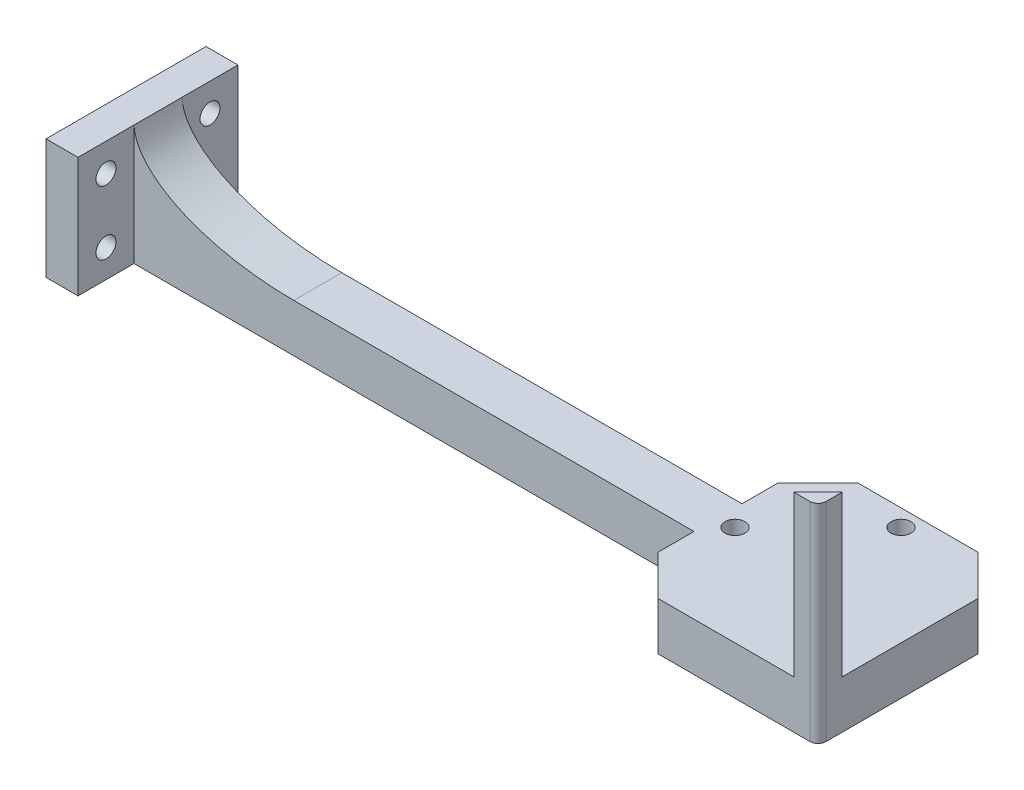
ISO-10303-21;
HEADER;
FILE_DESCRIPTION(('STEP AP214'),'2;1');
FILE_NAME('part.step','',(''),(''),'','','');
FILE_SCHEMA(('AUTOMOTIVE_DESIGN { 1 0 10303 214 1 1 1 1 }'));
ENDSEC;
DATA;
#1=APPLICATION_CONTEXT('core data for automotive mechanical design processes');
#2=APPLICATION_PROTOCOL_DEFINITION('international standard','automotive_design',2000,#1);
#3=PRODUCT_CONTEXT('',#1,'mechanical');
#4=PRODUCT('Part','Part','',(#3));
#5=PRODUCT_RELATED_PRODUCT_CATEGORY('part','',(#4));
#6=PRODUCT_DEFINITION_FORMATION('','',#4);
#7=PRODUCT_DEFINITION_CONTEXT('part definition',#1,'design');
#8=PRODUCT_DEFINITION('design','',#6,#7);
#9=PRODUCT_DEFINITION_SHAPE('','',#8);
#10=(LENGTH_UNIT() NAMED_UNIT(*) SI_UNIT(.MILLI.,.METRE.));
#11=(NAMED_UNIT(*) PLANE_ANGLE_UNIT() SI_UNIT($,.RADIAN.));
#12=(NAMED_UNIT(*) SI_UNIT($,.STERADIAN.) SOLID_ANGLE_UNIT());
#13=UNCERTAINTY_MEASURE_WITH_UNIT(LENGTH_MEASURE(1.E-05),#10,'distance_accuracy_value','');
#14=(GEOMETRIC_REPRESENTATION_CONTEXT(3) GLOBAL_UNCERTAINTY_ASSIGNED_CONTEXT((#13)) GLOBAL_UNIT_ASSIGNED_CONTEXT((#10,
#11,#12)) REPRESENTATION_CONTEXT('',''));
#15=CARTESIAN_POINT('',(0.,0.,0.));
#16=DIRECTION('',(0.,0.,1.));
#17=DIRECTION('',(1.,0.,0.));
#18=AXIS2_PLACEMENT_3D('',#15,#16,#17);
#19=CARTESIAN_POINT('',(0.,12.,0.));
#20=DIRECTION('',(0.,1.,0.));
#21=DIRECTION('',(0.,0.,1.));
#22=AXIS2_PLACEMENT_3D('',#19,#20,#21);
#23=PLANE('',#22);
#24=CARTESIAN_POINT('',(69.4117647058823,12.,-14.7173797712898));
#25=DIRECTION('',(0.,1.,0.));
#26=DIRECTION('',(0.,0.,1.));
#27=AXIS2_PLACEMENT_3D('',#24,#25,#26);
#28=CIRCLE('',#27,2.49999999999999);
#29=CARTESIAN_POINT('',(69.4117647058823,12.,-12.2173797712898));
#30=VERTEX_POINT('',#29);
#31=EDGE_CURVE('E791',#30,#30,#28,.F.);
#32=ORIENTED_EDGE('',*,*,#31,.T.);
#33=EDGE_LOOP('',(#32));
#34=FACE_BOUND('',#33,.T.);
#35=CARTESIAN_POINT('',(48.6517647058823,12.,6.04262022871021));
#36=DIRECTION('',(0.,1.,0.));
#37=DIRECTION('',(0.,0.,1.));
#38=AXIS2_PLACEMENT_3D('',#35,#36,#37);
#39=CIRCLE('',#38,2.49999999999999);
#40=CARTESIAN_POINT('',(48.6517647058823,12.,8.54262022871021));
#41=VERTEX_POINT('',#40);
#42=EDGE_CURVE('E795',#41,#41,#39,.F.);
#43=ORIENTED_EDGE('',*,*,#42,.T.);
#44=EDGE_LOOP('',(#43));
#45=FACE_BOUND('',#44,.T.);
#46=CARTESIAN_POINT('',(87.4117647058823,12.,24.0426202287102));
#47=DIRECTION('',(0.,1.,0.));
#48=DIRECTION('',(0.,0.,1.));
#49=AXIS2_PLACEMENT_3D('',#46,#47,#48);
#50=CIRCLE('',#49,2.5);
#51=CARTESIAN_POINT('',(87.4117647058823,12.,26.5426202287102));
#52=VERTEX_POINT('',#51);
#53=EDGE_CURVE('E801',#52,#52,#50,.T.);
#54=ORIENTED_EDGE('',*,*,#53,.F.);
#55=EDGE_LOOP('',(#54));
#56=FACE_BOUND('',#55,.T.);
#57=CARTESIAN_POINT('',(69.4117647058823,12.,6.04262022871021));
#58=DIRECTION('',(0.,1.,0.));
#59=DIRECTION('',(0.,0.,1.));
#60=AXIS2_PLACEMENT_3D('',#57,#58,#59);
#61=CIRCLE('',#60,4.25000000000001);
#62=CARTESIAN_POINT('',(69.4117647058823,12.,10.2926202287102));
#63=VERTEX_POINT('',#62);
#64=EDGE_CURVE('E225',#63,#63,#61,.T.);
#65=ORIENTED_EDGE('',*,*,#64,.F.);
#66=EDGE_LOOP('',(#65));
#67=FACE_BOUND('',#66,.T.);
#68=DIRECTION('',(1.,0.,0.));
#69=VECTOR('',#68,1.);
#70=CARTESIAN_POINT('',(0.,12.,31.0426202287102));
#71=LINE('',#70,#69);
#72=CARTESIAN_POINT('',(54.4117647058824,12.,31.0426202287102));
#73=VERTEX_POINT('',#72);
#74=CARTESIAN_POINT('',(88.4117647058823,12.,31.0426202287102));
#75=VERTEX_POINT('',#74);
#76=EDGE_CURVE('E488',#73,#75,#71,.T.);
#77=ORIENTED_EDGE('',*,*,#76,.T.);
#78=DIRECTION('',(-0.707106781186548,0.,0.707106781186547));
#79=VECTOR('',#78,1.);
#80=CARTESIAN_POINT('',(94.4117647058823,12.,25.0426202287102));
#81=LINE('',#80,#79);
#82=CARTESIAN_POINT('',(94.4117647058823,12.,25.0426202287102));
#83=VERTEX_POINT('',#82);
#84=EDGE_CURVE('E182',#83,#75,#81,.T.);
#85=ORIENTED_EDGE('',*,*,#84,.F.);
#86=DIRECTION('',(0.,0.,1.));
#87=VECTOR('',#86,1.);
#88=CARTESIAN_POINT('',(94.4117647058823,12.,0.));
#89=LINE('',#88,#87);
#90=CARTESIAN_POINT('',(94.4117647058823,12.,-8.95737977128982));
#91=VERTEX_POINT('',#90);
#92=EDGE_CURVE('E196',#91,#83,#89,.T.);
#93=ORIENTED_EDGE('',*,*,#92,.F.);
#94=DIRECTION('',(0.707106781186547,0.,0.707106781186548));
#95=VECTOR('',#94,1.);
#96=CARTESIAN_POINT('',(51.6845722385862,12.,-51.6845722385861));
#97=LINE('',#96,#95);
#98=CARTESIAN_POINT('',(84.4117647058824,12.,-18.9573797712898));
#99=VERTEX_POINT('',#98);
#100=EDGE_CURVE('E533',#91,#99,#97,.F.);
#101=ORIENTED_EDGE('',*,*,#100,.T.);
#102=DIRECTION('',(1.,0.,0.));
#103=VECTOR('',#102,1.);
#104=CARTESIAN_POINT('',(0.,12.,-18.9573797712898));
#105=LINE('',#104,#103);
#106=CARTESIAN_POINT('',(54.4117647058824,12.,-18.9573797712898));
#107=VERTEX_POINT('',#106);
#108=EDGE_CURVE('E526',#107,#99,#105,.T.);
#109=ORIENTED_EDGE('',*,*,#108,.F.);
#110=DIRECTION('',(-0.707106781186549,0.,0.707106781186547));
#111=VECTOR('',#110,1.);
#112=CARTESIAN_POINT('',(17.7271924672962,12.,17.7271924672963));
#113=LINE('',#112,#111);
#114=CARTESIAN_POINT('',(44.4117647058823,12.,-8.95737977128978));
#115=VERTEX_POINT('',#114);
#116=EDGE_CURVE('E535',#107,#115,#113,.T.);
#117=ORIENTED_EDGE('',*,*,#116,.T.);
#118=DIRECTION('',(0.,0.,1.));
#119=VECTOR('',#118,1.);
#120=CARTESIAN_POINT('',(44.4117647058823,12.,0.));
#121=LINE('',#120,#119);
#122=CARTESIAN_POINT('',(44.4117647058823,12.,0.0426202287102109));
#123=VERTEX_POINT('',#122);
#124=EDGE_CURVE('E523',#115,#123,#121,.T.);
#125=ORIENTED_EDGE('',*,*,#124,.T.);
#126=DIRECTION('',(-1.,0.,0.));
#127=VECTOR('',#126,1.);
#128=CARTESIAN_POINT('',(44.4117647058823,12.,0.0426202287102109));
#129=LINE('',#128,#127);
#130=CARTESIAN_POINT('',(-55.6382665832413,12.,0.0426202287102231));
#131=VERTEX_POINT('',#130);
#132=EDGE_CURVE('E464',#123,#131,#129,.T.);
#133=ORIENTED_EDGE('',*,*,#132,.T.);
#134=CARTESIAN_POINT('',(-55.6382665832413,12.,12.6426202287102));
#135=CARTESIAN_POINT('',(-55.6382665832413,12.,8.24262022871021));
#136=CARTESIAN_POINT('',(-55.6382665832413,12.,3.84262022871024));
#137=CARTESIAN_POINT('',(-55.6382665832413,12.,-0.557379771289768));
#138=(BOUNDED_CURVE() B_SPLINE_CURVE(3,(#134,#135,#136,#137),.UNSPECIFIED.,.F.,
.F.) B_SPLINE_CURVE_WITH_KNOTS((4,4),(0.0134,0.0266),
.UNSPECIFIED.) CURVE() GEOMETRIC_REPRESENTATION_ITEM() RATIONAL_B_SPLINE_CURVE((1.,1.,1.,1.)) REPRESENTATION_ITEM(''));
#139=CARTESIAN_POINT('',(-55.6382665832413,12.,12.0426202287102));
#140=VERTEX_POINT('',#139);
#141=EDGE_CURVE('E547',#131,#140,#138,.F.);
#142=ORIENTED_EDGE('',*,*,#141,.T.);
#143=DIRECTION('',(-1.,0.,0.));
#144=VECTOR('',#143,1.);
#145=CARTESIAN_POINT('',(44.4117647058823,12.,12.0426202287102));
#146=LINE('',#145,#144);
#147=CARTESIAN_POINT('',(44.4117647058823,12.,12.0426202287102));
#148=VERTEX_POINT('',#147);
#149=EDGE_CURVE('E456',#148,#140,#146,.T.);
#150=ORIENTED_EDGE('',*,*,#149,.F.);
#151=CARTESIAN_POINT('',(44.4117647058823,12.,21.0426202287102));
#152=VERTEX_POINT('',#151);
#153=EDGE_CURVE('E489',#148,#152,#121,.T.);
#154=ORIENTED_EDGE('',*,*,#153,.T.);
#155=DIRECTION('',(-0.707106781186547,0.,-0.707106781186548));
#156=VECTOR('',#155,1.);
#157=CARTESIAN_POINT('',(11.6845722385861,12.,-11.6845722385861));
#158=LINE('',#157,#156);
#159=EDGE_CURVE('E537',#152,#73,#158,.F.);
#160=ORIENTED_EDGE('',*,*,#159,.T.);
#161=EDGE_LOOP('',(#77,#85,#93,#101,#109,#117,#125,#133,#142,#150,#154,#160));
#162=FACE_BOUND('',#161,.T.);
#163=ADVANCED_FACE('F43',(#34,#45,#56,#67,#162),#23,.T.);
#164=CARTESIAN_POINT('',(-95.5882352941177,30.,26.0426202287102));
#165=DIRECTION('',(-1.,0.,0.));
#166=DIRECTION('',(0.,0.,1.));
#167=AXIS2_PLACEMENT_3D('',#164,#165,#166);
#168=PLANE('',#167);
#169=CARTESIAN_POINT('',(-95.5882352941177,7.,19.0426202287102));
#170=DIRECTION('',(-1.,0.,0.));
#171=DIRECTION('',(0.,0.,1.));
#172=AXIS2_PLACEMENT_3D('',#169,#170,#171);
#173=CIRCLE('',#172,2.5);
#174=CARTESIAN_POINT('',(-95.5882352941177,7.,21.5426202287102));
#175=VERTEX_POINT('',#174);
#176=EDGE_CURVE('E213',#175,#175,#173,.F.);
#177=ORIENTED_EDGE('',*,*,#176,.F.);
#178=EDGE_LOOP('',(#177));
#179=FACE_BOUND('',#178,.T.);
#180=CARTESIAN_POINT('',(-95.5882352941177,23.,19.0426202287102));
#181=DIRECTION('',(-1.,0.,0.));
#182=DIRECTION('',(0.,0.,1.));
#183=AXIS2_PLACEMENT_3D('',#180,#181,#182);
#184=CIRCLE('',#183,2.5);
#185=CARTESIAN_POINT('',(-95.5882352941177,23.,21.5426202287102));
#186=VERTEX_POINT('',#185);
#187=EDGE_CURVE('E207',#186,#186,#184,.F.);
#188=ORIENTED_EDGE('',*,*,#187,.F.);
#189=EDGE_LOOP('',(#188));
#190=FACE_BOUND('',#189,.T.);
#191=DIRECTION('',(0.,-1.,0.));
#192=VECTOR('',#191,1.);
#193=CARTESIAN_POINT('',(-95.5882352941177,12.,12.0426202287102));
#194=LINE('',#193,#192);
#195=CARTESIAN_POINT('',(-95.5882352941177,30.,12.0426202287102));
#196=VERTEX_POINT('',#195);
#197=CARTESIAN_POINT('',(-95.5882352941177,0.,12.0426202287102));
#198=VERTEX_POINT('',#197);
#199=EDGE_CURVE('E467',#196,#198,#194,.T.);
#200=ORIENTED_EDGE('',*,*,#199,.F.);
#201=DIRECTION('',(0.,0.,-1.));
#202=VECTOR('',#201,1.);
#203=CARTESIAN_POINT('',(-95.5882352941177,30.,12.0426202287102));
#204=LINE('',#203,#202);
#205=CARTESIAN_POINT('',(-95.5882352941177,30.,26.0426202287102));
#206=VERTEX_POINT('',#205);
#207=EDGE_CURVE('E241',#206,#196,#204,.T.);
#208=ORIENTED_EDGE('',*,*,#207,.F.);
#209=DIRECTION('',(0.,-1.,0.));
#210=VECTOR('',#209,1.);
#211=CARTESIAN_POINT('',(-95.5882352941177,30.,26.0426202287102));
#212=LINE('',#211,#210);
#213=CARTESIAN_POINT('',(-95.5882352941177,0.,26.0426202287102));
#214=VERTEX_POINT('',#213);
#215=EDGE_CURVE('E429',#206,#214,#212,.T.);
#216=ORIENTED_EDGE('',*,*,#215,.T.);
#217=DIRECTION('',(0.,0.,-1.));
#218=VECTOR('',#217,1.);
#219=CARTESIAN_POINT('',(-95.5882352941177,0.,26.0426202287102));
#220=LINE('',#219,#218);
#221=EDGE_CURVE('E434',#214,#198,#220,.T.);
#222=ORIENTED_EDGE('',*,*,#221,.T.);
#223=EDGE_LOOP('',(#200,#208,#216,#222));
#224=FACE_BOUND('',#223,.T.);
#225=ADVANCED_FACE('F260',(#179,#190,#224),#168,.F.);
#226=CARTESIAN_POINT('',(94.4117647058823,12.,0.));
#227=DIRECTION('',(1.,0.,0.));
#228=DIRECTION('',(0.,0.,-1.));
#229=AXIS2_PLACEMENT_3D('',#226,#227,#228);
#230=PLANE('',#229);
#231=DIRECTION('',(0.,0.,-1.));
#232=VECTOR('',#231,1.);
#233=CARTESIAN_POINT('',(94.4117647058823,52.,31.0426202287102));
#234=LINE('',#233,#232);
#235=CARTESIAN_POINT('',(94.4117647058823,52.,29.0426202287102));
#236=VERTEX_POINT('',#235);
#237=CARTESIAN_POINT('',(94.4117647058823,52.,25.0426202287102));
#238=VERTEX_POINT('',#237);
#239=EDGE_CURVE('E172',#236,#238,#234,.T.);
#240=ORIENTED_EDGE('',*,*,#239,.F.);
#241=DIRECTION('',(0.,-1.,0.));
#242=VECTOR('',#241,1.);
#243=CARTESIAN_POINT('',(94.4117647058823,0.,29.0426202287102));
#244=LINE('',#243,#242);
#245=CARTESIAN_POINT('',(94.4117647058823,0.,29.0426202287102));
#246=VERTEX_POINT('',#245);
#247=EDGE_CURVE('E375',#236,#246,#244,.T.);
#248=ORIENTED_EDGE('',*,*,#247,.T.);
#249=DIRECTION('',(0.,0.,1.));
#250=VECTOR('',#249,1.);
#251=CARTESIAN_POINT('',(94.4117647058823,0.,0.));
#252=LINE('',#251,#250);
#253=CARTESIAN_POINT('',(94.4117647058823,0.,-8.95737977128981));
#254=VERTEX_POINT('',#253);
#255=EDGE_CURVE('E476',#254,#246,#252,.T.);
#256=ORIENTED_EDGE('',*,*,#255,.F.);
#257=DIRECTION('',(0.,1.,0.));
#258=VECTOR('',#257,1.);
#259=CARTESIAN_POINT('',(94.4117647058823,12.,-8.95737977128981));
#260=LINE('',#259,#258);
#261=EDGE_CURVE('E546',#254,#91,#260,.T.);
#262=ORIENTED_EDGE('',*,*,#261,.T.);
#263=ORIENTED_EDGE('',*,*,#92,.T.);
#264=DIRECTION('',(0.,-1.,0.));
#265=VECTOR('',#264,1.);
#266=CARTESIAN_POINT('',(94.4117647058823,52.,25.0426202287102));
#267=LINE('',#266,#265);
#268=EDGE_CURVE('E188',#238,#83,#267,.T.);
#269=ORIENTED_EDGE('',*,*,#268,.F.);
#270=EDGE_LOOP('',(#240,#248,#256,#262,#263,#269));
#271=FACE_BOUND('',#270,.T.);
#272=ADVANCED_FACE('F194',(#271),#230,.T.);
#273=CARTESIAN_POINT('',(0.,12.,-18.9573797712898));
#274=DIRECTION('',(0.,0.,-1.));
#275=DIRECTION('',(-1.,0.,0.));
#276=AXIS2_PLACEMENT_3D('',#273,#274,#275);
#277=PLANE('',#276);
#278=DIRECTION('',(1.,0.,0.));
#279=VECTOR('',#278,1.);
#280=CARTESIAN_POINT('',(0.,0.,-18.9573797712898));
#281=LINE('',#280,#279);
#282=CARTESIAN_POINT('',(54.4117647058824,0.,-18.9573797712898));
#283=VERTEX_POINT('',#282);
#284=CARTESIAN_POINT('',(84.4117647058824,0.,-18.9573797712898));
#285=VERTEX_POINT('',#284);
#286=EDGE_CURVE('E514',#283,#285,#281,.T.);
#287=ORIENTED_EDGE('',*,*,#286,.F.);
#288=DIRECTION('',(0.,1.,0.));
#289=VECTOR('',#288,1.);
#290=CARTESIAN_POINT('',(54.4117647058824,12.,-18.9573797712898));
#291=LINE('',#290,#289);
#292=EDGE_CURVE('E545',#283,#107,#291,.T.);
#293=ORIENTED_EDGE('',*,*,#292,.T.);
#294=ORIENTED_EDGE('',*,*,#108,.T.);
#295=DIRECTION('',(0.,-1.,0.));
#296=VECTOR('',#295,1.);
#297=CARTESIAN_POINT('',(84.4117647058824,12.,-18.9573797712898));
#298=LINE('',#297,#296);
#299=EDGE_CURVE('E542',#99,#285,#298,.T.);
#300=ORIENTED_EDGE('',*,*,#299,.T.);
#301=EDGE_LOOP('',(#287,#293,#294,#300));
#302=FACE_BOUND('',#301,.T.);
#303=ADVANCED_FACE('F272',(#302),#277,.T.);
#304=CARTESIAN_POINT('',(0.,12.,31.0426202287102));
#305=DIRECTION('',(0.,0.,-1.));
#306=DIRECTION('',(-1.,0.,0.));
#307=AXIS2_PLACEMENT_3D('',#304,#305,#306);
#308=PLANE('',#307);
#309=DIRECTION('',(1.,0.,0.));
#310=VECTOR('',#309,1.);
#311=CARTESIAN_POINT('',(0.,0.,31.0426202287102));
#312=LINE('',#311,#310);
#313=CARTESIAN_POINT('',(54.4117647058824,0.,31.0426202287102));
#314=VERTEX_POINT('',#313);
#315=CARTESIAN_POINT('',(92.4117647058823,0.,31.0426202287102));
#316=VERTEX_POINT('',#315);
#317=EDGE_CURVE('E508',#314,#316,#312,.T.);
#318=ORIENTED_EDGE('',*,*,#317,.T.);
#319=DIRECTION('',(0.,-1.,0.));
#320=VECTOR('',#319,1.);
#321=CARTESIAN_POINT('',(92.4117647058823,52.,31.0426202287102));
#322=LINE('',#321,#320);
#323=CARTESIAN_POINT('',(92.4117647058823,52.,31.0426202287102));
#324=VERTEX_POINT('',#323);
#325=EDGE_CURVE('E50',#316,#324,#322,.F.);
#326=ORIENTED_EDGE('',*,*,#325,.T.);
#327=DIRECTION('',(1.,0.,0.));
#328=VECTOR('',#327,1.);
#329=CARTESIAN_POINT('',(88.4117647058823,52.,31.0426202287102));
#330=LINE('',#329,#328);
#331=CARTESIAN_POINT('',(88.4117647058823,52.,31.0426202287102));
#332=VERTEX_POINT('',#331);
#333=EDGE_CURVE('E191',#332,#324,#330,.T.);
#334=ORIENTED_EDGE('',*,*,#333,.F.);
#335=DIRECTION('',(0.,-1.,0.));
#336=VECTOR('',#335,1.);
#337=CARTESIAN_POINT('',(88.4117647058823,52.,31.0426202287102));
#338=LINE('',#337,#336);
#339=EDGE_CURVE('E190',#332,#75,#338,.T.);
#340=ORIENTED_EDGE('',*,*,#339,.T.);
#341=ORIENTED_EDGE('',*,*,#76,.F.);
#342=DIRECTION('',(0.,-1.,0.));
#343=VECTOR('',#342,1.);
#344=CARTESIAN_POINT('',(54.4117647058824,12.,31.0426202287102));
#345=LINE('',#344,#343);
#346=EDGE_CURVE('E493',#73,#314,#345,.T.);
#347=ORIENTED_EDGE('',*,*,#346,.T.);
#348=EDGE_LOOP('',(#318,#326,#334,#340,#341,#347));
#349=FACE_BOUND('',#348,.T.);
#350=ADVANCED_FACE('F268',(#349),#308,.F.);
#351=CARTESIAN_POINT('',(0.,0.,0.));
#352=DIRECTION('',(0.,1.,0.));
#353=DIRECTION('',(0.,0.,1.));
#354=AXIS2_PLACEMENT_3D('',#351,#352,#353);
#355=PLANE('',#354);
#356=CARTESIAN_POINT('',(69.4117647058823,0.,-14.7173797712898));
#357=DIRECTION('',(0.,-1.,0.));
#358=DIRECTION('',(0.,0.,-1.));
#359=AXIS2_PLACEMENT_3D('',#356,#357,#358);
#360=CIRCLE('',#359,2.49999999999999);
#361=CARTESIAN_POINT('',(69.4117647058823,0.,-17.2173797712898));
#362=VERTEX_POINT('',#361);
#363=EDGE_CURVE('E788',#362,#362,#360,.T.);
#364=ORIENTED_EDGE('',*,*,#363,.F.);
#365=EDGE_LOOP('',(#364));
#366=FACE_BOUND('',#365,.T.);
#367=CARTESIAN_POINT('',(48.6517647058823,0.,6.04262022871021));
#368=DIRECTION('',(0.,-1.,0.));
#369=DIRECTION('',(0.,0.,-1.));
#370=AXIS2_PLACEMENT_3D('',#367,#368,#369);
#371=CIRCLE('',#370,2.49999999999999);
#372=CARTESIAN_POINT('',(48.6517647058823,0.,3.54262022871022));
#373=VERTEX_POINT('',#372);
#374=EDGE_CURVE('E792',#373,#373,#371,.T.);
#375=ORIENTED_EDGE('',*,*,#374,.F.);
#376=EDGE_LOOP('',(#375));
#377=FACE_BOUND('',#376,.T.);
#378=CARTESIAN_POINT('',(87.4117647058823,0.,24.0426202287102));
#379=DIRECTION('',(0.,1.,0.));
#380=DIRECTION('',(0.,0.,1.));
#381=AXIS2_PLACEMENT_3D('',#378,#379,#380);
#382=CIRCLE('',#381,2.5);
#383=CARTESIAN_POINT('',(87.4117647058823,0.,26.5426202287102));
#384=VERTEX_POINT('',#383);
#385=EDGE_CURVE('E804',#384,#384,#382,.F.);
#386=ORIENTED_EDGE('',*,*,#385,.F.);
#387=EDGE_LOOP('',(#386));
#388=FACE_BOUND('',#387,.T.);
#389=CARTESIAN_POINT('',(69.4117647058823,0.,6.04262022871021));
#390=DIRECTION('',(0.,1.,0.));
#391=DIRECTION('',(0.,0.,1.));
#392=AXIS2_PLACEMENT_3D('',#389,#390,#391);
#393=CIRCLE('',#392,4.25000000000001);
#394=CARTESIAN_POINT('',(69.4117647058823,0.,10.2926202287102));
#395=VERTEX_POINT('',#394);
#396=EDGE_CURVE('E228',#395,#395,#393,.T.);
#397=ORIENTED_EDGE('',*,*,#396,.T.);
#398=EDGE_LOOP('',(#397));
#399=FACE_BOUND('',#398,.T.);
#400=ORIENTED_EDGE('',*,*,#255,.T.);
#401=CARTESIAN_POINT('',(92.4117647058823,0.,29.0426202287102));
#402=DIRECTION('',(0.,1.,0.));
#403=DIRECTION('',(0.,0.,1.));
#404=AXIS2_PLACEMENT_3D('',#401,#402,#403);
#405=CIRCLE('',#404,2.);
#406=EDGE_CURVE('E64',#246,#316,#405,.F.);
#407=ORIENTED_EDGE('',*,*,#406,.T.);
#408=ORIENTED_EDGE('',*,*,#317,.F.);
#409=DIRECTION('',(0.707106781186547,0.,0.707106781186548));
#410=VECTOR('',#409,1.);
#411=CARTESIAN_POINT('',(54.4117647058824,0.,31.0426202287102));
#412=LINE('',#411,#410);
#413=CARTESIAN_POINT('',(44.4117647058823,0.,21.0426202287102));
#414=VERTEX_POINT('',#413);
#415=EDGE_CURVE('E599',#314,#414,#412,.F.);
#416=ORIENTED_EDGE('',*,*,#415,.T.);
#417=DIRECTION('',(0.,0.,1.));
#418=VECTOR('',#417,1.);
#419=CARTESIAN_POINT('',(44.4117647058823,0.,0.));
#420=LINE('',#419,#418);
#421=CARTESIAN_POINT('',(44.4117647058823,0.,12.0426202287102));
#422=VERTEX_POINT('',#421);
#423=EDGE_CURVE('E509',#422,#414,#420,.T.);
#424=ORIENTED_EDGE('',*,*,#423,.F.);
#425=DIRECTION('',(-1.,0.,0.));
#426=VECTOR('',#425,1.);
#427=CARTESIAN_POINT('',(44.4117647058823,0.,12.0426202287102));
#428=LINE('',#427,#426);
#429=EDGE_CURVE('E449',#422,#198,#428,.T.);
#430=ORIENTED_EDGE('',*,*,#429,.T.);
#431=ORIENTED_EDGE('',*,*,#221,.F.);
#432=DIRECTION('',(1.,0.,0.));
#433=VECTOR('',#432,1.);
#434=CARTESIAN_POINT('',(-103.588235294118,0.,26.0426202287102));
#435=LINE('',#434,#433);
#436=CARTESIAN_POINT('',(-103.588235294118,0.,26.0426202287102));
#437=VERTEX_POINT('',#436);
#438=EDGE_CURVE('E423',#437,#214,#435,.T.);
#439=ORIENTED_EDGE('',*,*,#438,.F.);
#440=DIRECTION('',(0.,0.,1.));
#441=VECTOR('',#440,1.);
#442=CARTESIAN_POINT('',(-103.588235294118,0.,-13.9573797712898));
#443=LINE('',#442,#441);
#444=CARTESIAN_POINT('',(-103.588235294118,0.,-13.9573797712898));
#445=VERTEX_POINT('',#444);
#446=EDGE_CURVE('E414',#445,#437,#443,.T.);
#447=ORIENTED_EDGE('',*,*,#446,.F.);
#448=DIRECTION('',(-1.,0.,0.));
#449=VECTOR('',#448,1.);
#450=CARTESIAN_POINT('',(-95.5882352941177,0.,-13.9573797712898));
#451=LINE('',#450,#449);
#452=CARTESIAN_POINT('',(-95.5882352941177,0.,-13.9573797712898));
#453=VERTEX_POINT('',#452);
#454=EDGE_CURVE('E231',#453,#445,#451,.T.);
#455=ORIENTED_EDGE('',*,*,#454,.F.);
#456=CARTESIAN_POINT('',(-95.5882352941177,0.,0.042620228710228));
#457=VERTEX_POINT('',#456);
#458=EDGE_CURVE('E435',#457,#453,#220,.T.);
#459=ORIENTED_EDGE('',*,*,#458,.F.);
#460=DIRECTION('',(-1.,0.,0.));
#461=VECTOR('',#460,1.);
#462=CARTESIAN_POINT('',(44.4117647058823,0.,0.0426202287102109));
#463=LINE('',#462,#461);
#464=CARTESIAN_POINT('',(44.4117647058823,0.,0.0426202287102109));
#465=VERTEX_POINT('',#464);
#466=EDGE_CURVE('E452',#465,#457,#463,.T.);
#467=ORIENTED_EDGE('',*,*,#466,.F.);
#468=CARTESIAN_POINT('',(44.4117647058823,0.,-8.95737977128978));
#469=VERTEX_POINT('',#468);
#470=EDGE_CURVE('E506',#469,#465,#420,.T.);
#471=ORIENTED_EDGE('',*,*,#470,.F.);
#472=DIRECTION('',(0.707106781186549,0.,-0.707106781186547));
#473=VECTOR('',#472,1.);
#474=CARTESIAN_POINT('',(44.4117647058823,0.,-8.95737977128978));
#475=LINE('',#474,#473);
#476=EDGE_CURVE('E502',#469,#283,#475,.T.);
#477=ORIENTED_EDGE('',*,*,#476,.T.);
#478=ORIENTED_EDGE('',*,*,#286,.T.);
#479=DIRECTION('',(-0.707106781186547,0.,-0.707106781186548));
#480=VECTOR('',#479,1.);
#481=CARTESIAN_POINT('',(84.4117647058824,0.,-18.9573797712898));
#482=LINE('',#481,#480);
#483=EDGE_CURVE('E498',#285,#254,#482,.F.);
#484=ORIENTED_EDGE('',*,*,#483,.T.);
#485=EDGE_LOOP('',(#400,#407,#408,#416,#424,#430,#431,#439,#447,#455,#459,#467,#471,#477,#478,#484));
#486=FACE_BOUND('',#485,.T.);
#487=ADVANCED_FACE('F264',(#366,#377,#388,#399,#486),#355,.F.);
#488=CARTESIAN_POINT('',(44.4117647058823,12.,0.));
#489=DIRECTION('',(1.,0.,0.));
#490=DIRECTION('',(0.,0.,-1.));
#491=AXIS2_PLACEMENT_3D('',#488,#489,#490);
#492=PLANE('',#491);
#493=ORIENTED_EDGE('',*,*,#423,.T.);
#494=DIRECTION('',(0.,1.,0.));
#495=VECTOR('',#494,1.);
#496=CARTESIAN_POINT('',(44.4117647058823,12.,21.0426202287102));
#497=LINE('',#496,#495);
#498=EDGE_CURVE('E531',#414,#152,#497,.T.);
#499=ORIENTED_EDGE('',*,*,#498,.T.);
#500=ORIENTED_EDGE('',*,*,#153,.F.);
#501=DIRECTION('',(0.,-1.,0.));
#502=VECTOR('',#501,1.);
#503=CARTESIAN_POINT('',(44.4117647058823,12.,12.0426202287102));
#504=LINE('',#503,#502);
#505=EDGE_CURVE('E485',#148,#422,#504,.T.);
#506=ORIENTED_EDGE('',*,*,#505,.T.);
#507=EDGE_LOOP('',(#493,#499,#500,#506));
#508=FACE_BOUND('',#507,.T.);
#509=ADVANCED_FACE('F267',(#508),#492,.F.);
#510=ORIENTED_EDGE('',*,*,#124,.F.);
#511=DIRECTION('',(0.,-1.,0.));
#512=VECTOR('',#511,1.);
#513=CARTESIAN_POINT('',(44.4117647058823,0.,-8.95737977128978));
#514=LINE('',#513,#512);
#515=EDGE_CURVE('E539',#115,#469,#514,.T.);
#516=ORIENTED_EDGE('',*,*,#515,.T.);
#517=ORIENTED_EDGE('',*,*,#470,.T.);
#518=DIRECTION('',(0.,-1.,0.));
#519=VECTOR('',#518,1.);
#520=CARTESIAN_POINT('',(44.4117647058823,12.,0.0426202287102109));
#521=LINE('',#520,#519);
#522=EDGE_CURVE('E487',#123,#465,#521,.T.);
#523=ORIENTED_EDGE('',*,*,#522,.F.);
#524=EDGE_LOOP('',(#510,#516,#517,#523));
#525=FACE_BOUND('',#524,.T.);
#526=ADVANCED_FACE('F275',(#525),#492,.F.);
#527=CARTESIAN_POINT('',(44.4117647058823,12.,12.0426202287102));
#528=DIRECTION('',(0.,0.,1.));
#529=DIRECTION('',(1.,0.,0.));
#530=AXIS2_PLACEMENT_3D('',#527,#528,#529);
#531=PLANE('',#530);
#532=ORIENTED_EDGE('',*,*,#429,.F.);
#533=ORIENTED_EDGE('',*,*,#505,.F.);
#534=ORIENTED_EDGE('',*,*,#149,.T.);
#535=CARTESIAN_POINT('',(-95.5882352941177,30.,12.0426202287102));
#536=CARTESIAN_POINT('',(-94.6871081803385,12.,12.0426202287102));
#537=CARTESIAN_POINT('',(-55.6382665832413,12.,12.0426202287102));
#538=(BOUNDED_CURVE() B_SPLINE_CURVE(2,(#535,#536,#537),.UNSPECIFIED.,.F.,
.F.) B_SPLINE_CURVE_WITH_KNOTS((3,3),(0.,1.),
.UNSPECIFIED.) CURVE() GEOMETRIC_REPRESENTATION_ITEM() RATIONAL_B_SPLINE_CURVE((1.,
0.724568837309472,1.)) REPRESENTATION_ITEM(''));
#539=EDGE_CURVE('E306',#140,#196,#538,.F.);
#540=ORIENTED_EDGE('',*,*,#539,.T.);
#541=ORIENTED_EDGE('',*,*,#199,.T.);
#542=EDGE_LOOP('',(#532,#533,#534,#540,#541));
#543=FACE_BOUND('',#542,.T.);
#544=ADVANCED_FACE('F286',(#543),#531,.T.);
#545=CARTESIAN_POINT('',(44.4117647058823,12.,0.0426202287102109));
#546=DIRECTION('',(0.,0.,1.));
#547=DIRECTION('',(1.,0.,0.));
#548=AXIS2_PLACEMENT_3D('',#545,#546,#547);
#549=PLANE('',#548);
#550=ORIENTED_EDGE('',*,*,#466,.T.);
#551=DIRECTION('',(0.,-1.,0.));
#552=VECTOR('',#551,1.);
#553=CARTESIAN_POINT('',(-95.5882352941177,12.,0.042620228710228));
#554=LINE('',#553,#552);
#555=CARTESIAN_POINT('',(-95.5882352941177,30.,0.042620228710228));
#556=VERTEX_POINT('',#555);
#557=EDGE_CURVE('E472',#556,#457,#554,.T.);
#558=ORIENTED_EDGE('',*,*,#557,.F.);
#559=CARTESIAN_POINT('',(-55.6382665832413,12.,0.042620228710224));
#560=CARTESIAN_POINT('',(-94.6871081803385,12.,0.042620228710224));
#561=CARTESIAN_POINT('',(-95.5882352941177,30.,0.042620228710224));
#562=(BOUNDED_CURVE() B_SPLINE_CURVE(2,(#559,#560,#561),.UNSPECIFIED.,.F.,
.F.) B_SPLINE_CURVE_WITH_KNOTS((3,3),(0.,1.),
.UNSPECIFIED.) CURVE() GEOMETRIC_REPRESENTATION_ITEM() RATIONAL_B_SPLINE_CURVE((1.,
0.724568837309472,1.)) REPRESENTATION_ITEM(''));
#563=EDGE_CURVE('E552',#556,#131,#562,.F.);
#564=ORIENTED_EDGE('',*,*,#563,.T.);
#565=ORIENTED_EDGE('',*,*,#132,.F.);
#566=ORIENTED_EDGE('',*,*,#522,.T.);
#567=EDGE_LOOP('',(#550,#558,#564,#565,#566));
#568=FACE_BOUND('',#567,.T.);
#569=ADVANCED_FACE('F282',(#568),#549,.F.);
#570=CARTESIAN_POINT('',(-95.5882352941177,30.,-13.9573797712898));
#571=DIRECTION('',(0.,0.,1.));
#572=DIRECTION('',(1.,0.,0.));
#573=AXIS2_PLACEMENT_3D('',#570,#571,#572);
#574=PLANE('',#573);
#575=ORIENTED_EDGE('',*,*,#454,.T.);
#576=DIRECTION('',(0.,-1.,0.));
#577=VECTOR('',#576,1.);
#578=CARTESIAN_POINT('',(-103.588235294118,30.,-13.9573797712898));
#579=LINE('',#578,#577);
#580=CARTESIAN_POINT('',(-103.588235294118,30.,-13.9573797712898));
#581=VERTEX_POINT('',#580);
#582=EDGE_CURVE('E420',#581,#445,#579,.T.);
#583=ORIENTED_EDGE('',*,*,#582,.F.);
#584=DIRECTION('',(-1.,0.,0.));
#585=VECTOR('',#584,1.);
#586=CARTESIAN_POINT('',(-95.5882352941177,30.,-13.9573797712898));
#587=LINE('',#586,#585);
#588=CARTESIAN_POINT('',(-95.5882352941177,30.,-13.9573797712898));
#589=VERTEX_POINT('',#588);
#590=EDGE_CURVE('E234',#589,#581,#587,.T.);
#591=ORIENTED_EDGE('',*,*,#590,.F.);
#592=DIRECTION('',(0.,-1.,0.));
#593=VECTOR('',#592,1.);
#594=CARTESIAN_POINT('',(-95.5882352941177,30.,-13.9573797712898));
#595=LINE('',#594,#593);
#596=EDGE_CURVE('E446',#589,#453,#595,.T.);
#597=ORIENTED_EDGE('',*,*,#596,.T.);
#598=EDGE_LOOP('',(#575,#583,#591,#597));
#599=FACE_BOUND('',#598,.T.);
#600=ADVANCED_FACE('F262',(#599),#574,.F.);
#601=CARTESIAN_POINT('',(-103.588235294118,30.,-13.9573797712898));
#602=DIRECTION('',(1.,0.,0.));
#603=DIRECTION('',(0.,0.,-1.));
#604=AXIS2_PLACEMENT_3D('',#601,#602,#603);
#605=PLANE('',#604);
#606=CARTESIAN_POINT('',(-103.588235294118,23.,-6.95737977128978));
#607=DIRECTION('',(-1.,0.,0.));
#608=DIRECTION('',(0.,0.,1.));
#609=AXIS2_PLACEMENT_3D('',#606,#607,#608);
#610=CIRCLE('',#609,2.5);
#611=CARTESIAN_POINT('',(-103.588235294118,23.,-4.45737977128978));
#612=VERTEX_POINT('',#611);
#613=EDGE_CURVE('E200',#612,#612,#610,.T.);
#614=ORIENTED_EDGE('',*,*,#613,.F.);
#615=EDGE_LOOP('',(#614));
#616=FACE_BOUND('',#615,.T.);
#617=CARTESIAN_POINT('',(-103.588235294118,23.,19.0426202287102));
#618=DIRECTION('',(-1.,0.,0.));
#619=DIRECTION('',(0.,0.,1.));
#620=AXIS2_PLACEMENT_3D('',#617,#618,#619);
#621=CIRCLE('',#620,2.5);
#622=CARTESIAN_POINT('',(-103.588235294118,23.,21.5426202287102));
#623=VERTEX_POINT('',#622);
#624=EDGE_CURVE('E210',#623,#623,#621,.T.);
#625=ORIENTED_EDGE('',*,*,#624,.F.);
#626=EDGE_LOOP('',(#625));
#627=FACE_BOUND('',#626,.T.);
#628=CARTESIAN_POINT('',(-103.588235294118,7.,19.0426202287102));
#629=DIRECTION('',(-1.,0.,0.));
#630=DIRECTION('',(0.,0.,1.));
#631=AXIS2_PLACEMENT_3D('',#628,#629,#630);
#632=CIRCLE('',#631,2.5);
#633=CARTESIAN_POINT('',(-103.588235294118,7.,21.5426202287102));
#634=VERTEX_POINT('',#633);
#635=EDGE_CURVE('E216',#634,#634,#632,.T.);
#636=ORIENTED_EDGE('',*,*,#635,.F.);
#637=EDGE_LOOP('',(#636));
#638=FACE_BOUND('',#637,.T.);
#639=CARTESIAN_POINT('',(-103.588235294118,7.,-6.95737977128978));
#640=DIRECTION('',(-1.,0.,0.));
#641=DIRECTION('',(0.,0.,1.));
#642=AXIS2_PLACEMENT_3D('',#639,#640,#641);
#643=CIRCLE('',#642,2.5);
#644=CARTESIAN_POINT('',(-103.588235294118,7.,-4.45737977128978));
#645=VERTEX_POINT('',#644);
#646=EDGE_CURVE('E219',#645,#645,#643,.T.);
#647=ORIENTED_EDGE('',*,*,#646,.F.);
#648=EDGE_LOOP('',(#647));
#649=FACE_BOUND('',#648,.T.);
#650=ORIENTED_EDGE('',*,*,#446,.T.);
#651=DIRECTION('',(0.,-1.,0.));
#652=VECTOR('',#651,1.);
#653=CARTESIAN_POINT('',(-103.588235294118,30.,26.0426202287102));
#654=LINE('',#653,#652);
#655=CARTESIAN_POINT('',(-103.588235294118,30.,26.0426202287102));
#656=VERTEX_POINT('',#655);
#657=EDGE_CURVE('E417',#656,#437,#654,.T.);
#658=ORIENTED_EDGE('',*,*,#657,.F.);
#659=DIRECTION('',(0.,0.,1.));
#660=VECTOR('',#659,1.);
#661=CARTESIAN_POINT('',(-103.588235294118,30.,-13.9573797712898));
#662=LINE('',#661,#660);
#663=EDGE_CURVE('E596',#581,#656,#662,.T.);
#664=ORIENTED_EDGE('',*,*,#663,.F.);
#665=ORIENTED_EDGE('',*,*,#582,.T.);
#666=EDGE_LOOP('',(#650,#658,#664,#665));
#667=FACE_BOUND('',#666,.T.);
#668=ADVANCED_FACE('F395',(#616,#627,#638,#649,#667),#605,.F.);
#669=CARTESIAN_POINT('',(-103.588235294118,30.,26.0426202287102));
#670=DIRECTION('',(0.,0.,-1.));
#671=DIRECTION('',(-1.,0.,0.));
#672=AXIS2_PLACEMENT_3D('',#669,#670,#671);
#673=PLANE('',#672);
#674=ORIENTED_EDGE('',*,*,#438,.T.);
#675=ORIENTED_EDGE('',*,*,#215,.F.);
#676=DIRECTION('',(1.,0.,0.));
#677=VECTOR('',#676,1.);
#678=CARTESIAN_POINT('',(-103.588235294118,30.,26.0426202287102));
#679=LINE('',#678,#677);
#680=EDGE_CURVE('E428',#656,#206,#679,.T.);
#681=ORIENTED_EDGE('',*,*,#680,.F.);
#682=ORIENTED_EDGE('',*,*,#657,.T.);
#683=EDGE_LOOP('',(#674,#675,#681,#682));
#684=FACE_BOUND('',#683,.T.);
#685=ADVANCED_FACE('F392',(#684),#673,.F.);
#686=CARTESIAN_POINT('',(-95.5882352941177,23.,-6.95737977128978));
#687=DIRECTION('',(-1.,0.,0.));
#688=DIRECTION('',(0.,0.,1.));
#689=AXIS2_PLACEMENT_3D('',#686,#687,#688);
#690=CIRCLE('',#689,2.5);
#691=CARTESIAN_POINT('',(-95.5882352941177,23.,-4.45737977128978));
#692=VERTEX_POINT('',#691);
#693=EDGE_CURVE('E197',#692,#692,#690,.F.);
#694=ORIENTED_EDGE('',*,*,#693,.F.);
#695=EDGE_LOOP('',(#694));
#696=FACE_BOUND('',#695,.T.);
#697=CARTESIAN_POINT('',(-95.5882352941177,7.,-6.95737977128978));
#698=DIRECTION('',(-1.,0.,0.));
#699=DIRECTION('',(0.,0.,1.));
#700=AXIS2_PLACEMENT_3D('',#697,#698,#699);
#701=CIRCLE('',#700,2.5);
#702=CARTESIAN_POINT('',(-95.5882352941177,7.,-4.45737977128978));
#703=VERTEX_POINT('',#702);
#704=EDGE_CURVE('E222',#703,#703,#701,.F.);
#705=ORIENTED_EDGE('',*,*,#704,.F.);
#706=EDGE_LOOP('',(#705));
#707=FACE_BOUND('',#706,.T.);
#708=EDGE_CURVE('E238',#556,#589,#204,.T.);
#709=ORIENTED_EDGE('',*,*,#708,.F.);
#710=ORIENTED_EDGE('',*,*,#557,.T.);
#711=ORIENTED_EDGE('',*,*,#458,.T.);
#712=ORIENTED_EDGE('',*,*,#596,.F.);
#713=EDGE_LOOP('',(#709,#710,#711,#712));
#714=FACE_BOUND('',#713,.T.);
#715=ADVANCED_FACE('F388',(#696,#707,#714),#168,.F.);
#716=CARTESIAN_POINT('',(0.,30.,0.));
#717=DIRECTION('',(0.,1.,0.));
#718=DIRECTION('',(0.,0.,1.));
#719=AXIS2_PLACEMENT_3D('',#716,#717,#718);
#720=PLANE('',#719);
#721=ORIENTED_EDGE('',*,*,#207,.T.);
#722=CARTESIAN_POINT('',(-95.5882352941177,30.,-0.557379771289768));
#723=CARTESIAN_POINT('',(-95.5882352941177,30.,3.84262022871024));
#724=CARTESIAN_POINT('',(-95.5882352941177,30.,8.24262022871021));
#725=CARTESIAN_POINT('',(-95.5882352941177,30.,12.6426202287102));
#726=(BOUNDED_CURVE() B_SPLINE_CURVE(3,(#722,#723,#724,#725),.UNSPECIFIED.,.F.,
.F.) B_SPLINE_CURVE_WITH_KNOTS((4,4),(0.0134,0.0266),
.UNSPECIFIED.) CURVE() GEOMETRIC_REPRESENTATION_ITEM() RATIONAL_B_SPLINE_CURVE((1.,1.,1.,1.)) REPRESENTATION_ITEM(''));
#727=EDGE_CURVE('E244',#196,#556,#726,.F.);
#728=ORIENTED_EDGE('',*,*,#727,.T.);
#729=ORIENTED_EDGE('',*,*,#708,.T.);
#730=ORIENTED_EDGE('',*,*,#590,.T.);
#731=ORIENTED_EDGE('',*,*,#663,.T.);
#732=ORIENTED_EDGE('',*,*,#680,.T.);
#733=EDGE_LOOP('',(#721,#728,#729,#730,#731,#732));
#734=FACE_BOUND('',#733,.T.);
#735=ADVANCED_FACE('F377',(#734),#720,.T.);
#736=CARTESIAN_POINT('',(69.4117647058823,-4.99999999997031E-05,6.04262022871021));
#737=DIRECTION('',(0.,1.,0.));
#738=DIRECTION('',(0.,0.,1.));
#739=AXIS2_PLACEMENT_3D('',#736,#737,#738);
#740=CYLINDRICAL_SURFACE('',#739,4.25000000000001);
#741=ORIENTED_EDGE('',*,*,#64,.T.);
#742=EDGE_LOOP('',(#741));
#743=FACE_BOUND('',#742,.T.);
#744=ORIENTED_EDGE('',*,*,#396,.F.);
#745=EDGE_LOOP('',(#744));
#746=FACE_BOUND('',#745,.T.);
#747=ADVANCED_FACE('F387',(#743,#746),#740,.F.);
#748=CARTESIAN_POINT('',(-88.5171674822522,7.,-6.95737977128978));
#749=DIRECTION('',(-1.,0.,0.));
#750=DIRECTION('',(0.,0.,1.));
#751=AXIS2_PLACEMENT_3D('',#748,#749,#750);
#752=CYLINDRICAL_SURFACE('',#751,2.5);
#753=ORIENTED_EDGE('',*,*,#704,.T.);
#754=EDGE_LOOP('',(#753));
#755=FACE_BOUND('',#754,.T.);
#756=ORIENTED_EDGE('',*,*,#646,.T.);
#757=EDGE_LOOP('',(#756));
#758=FACE_BOUND('',#757,.T.);
#759=ADVANCED_FACE('F582',(#755,#758),#752,.F.);
#760=CARTESIAN_POINT('',(-88.5171674822522,7.,19.0426202287102));
#761=DIRECTION('',(-1.,0.,0.));
#762=DIRECTION('',(0.,0.,1.));
#763=AXIS2_PLACEMENT_3D('',#760,#761,#762);
#764=CYLINDRICAL_SURFACE('',#763,2.5);
#765=ORIENTED_EDGE('',*,*,#176,.T.);
#766=EDGE_LOOP('',(#765));
#767=FACE_BOUND('',#766,.T.);
#768=ORIENTED_EDGE('',*,*,#635,.T.);
#769=EDGE_LOOP('',(#768));
#770=FACE_BOUND('',#769,.T.);
#771=ADVANCED_FACE('F579',(#767,#770),#764,.F.);
#772=CARTESIAN_POINT('',(-88.5171674822522,23.,19.0426202287102));
#773=DIRECTION('',(-1.,0.,0.));
#774=DIRECTION('',(0.,0.,1.));
#775=AXIS2_PLACEMENT_3D('',#772,#773,#774);
#776=CYLINDRICAL_SURFACE('',#775,2.5);
#777=ORIENTED_EDGE('',*,*,#187,.T.);
#778=EDGE_LOOP('',(#777));
#779=FACE_BOUND('',#778,.T.);
#780=ORIENTED_EDGE('',*,*,#624,.T.);
#781=EDGE_LOOP('',(#780));
#782=FACE_BOUND('',#781,.T.);
#783=ADVANCED_FACE('F575',(#779,#782),#776,.F.);
#784=CARTESIAN_POINT('',(-88.5171674822522,23.,-6.95737977128978));
#785=DIRECTION('',(-1.,0.,0.));
#786=DIRECTION('',(0.,0.,1.));
#787=AXIS2_PLACEMENT_3D('',#784,#785,#786);
#788=CYLINDRICAL_SURFACE('',#787,2.5);
#789=ORIENTED_EDGE('',*,*,#693,.T.);
#790=EDGE_LOOP('',(#789));
#791=FACE_BOUND('',#790,.T.);
#792=ORIENTED_EDGE('',*,*,#613,.T.);
#793=EDGE_LOOP('',(#792));
#794=FACE_BOUND('',#793,.T.);
#795=ADVANCED_FACE('F571',(#791,#794),#788,.F.);
#796=CARTESIAN_POINT('',(54.4117647058824,12.,31.0426202287102));
#797=DIRECTION('',(0.707106781186548,0.,-0.707106781186547));
#798=DIRECTION('',(0.,-1.,0.));
#799=AXIS2_PLACEMENT_3D('',#796,#797,#798);
#800=PLANE('',#799);
#801=ORIENTED_EDGE('',*,*,#159,.F.);
#802=ORIENTED_EDGE('',*,*,#498,.F.);
#803=ORIENTED_EDGE('',*,*,#415,.F.);
#804=ORIENTED_EDGE('',*,*,#346,.F.);
#805=EDGE_LOOP('',(#801,#802,#803,#804));
#806=FACE_BOUND('',#805,.T.);
#807=ADVANCED_FACE('F574',(#806),#800,.F.);
#808=CARTESIAN_POINT('',(44.4117647058823,12.,-8.95737977128978));
#809=DIRECTION('',(-0.707106781186547,0.,-0.707106781186549));
#810=DIRECTION('',(0.,1.,0.));
#811=AXIS2_PLACEMENT_3D('',#808,#809,#810);
#812=PLANE('',#811);
#813=ORIENTED_EDGE('',*,*,#116,.F.);
#814=ORIENTED_EDGE('',*,*,#292,.F.);
#815=ORIENTED_EDGE('',*,*,#476,.F.);
#816=ORIENTED_EDGE('',*,*,#515,.F.);
#817=EDGE_LOOP('',(#813,#814,#815,#816));
#818=FACE_BOUND('',#817,.T.);
#819=ADVANCED_FACE('F609',(#818),#812,.T.);
#820=CARTESIAN_POINT('',(84.4117647058824,12.,-18.9573797712898));
#821=DIRECTION('',(-0.707106781186548,0.,0.707106781186547));
#822=DIRECTION('',(0.,-1.,0.));
#823=AXIS2_PLACEMENT_3D('',#820,#821,#822);
#824=PLANE('',#823);
#825=ORIENTED_EDGE('',*,*,#100,.F.);
#826=ORIENTED_EDGE('',*,*,#261,.F.);
#827=ORIENTED_EDGE('',*,*,#483,.F.);
#828=ORIENTED_EDGE('',*,*,#299,.F.);
#829=EDGE_LOOP('',(#825,#826,#827,#828));
#830=FACE_BOUND('',#829,.T.);
#831=ADVANCED_FACE('F325',(#830),#824,.F.);
#832=CARTESIAN_POINT('',(-95.5882352941177,30.,12.6426202287102));
#833=CARTESIAN_POINT('',(-95.5882352941177,30.,8.24262022871021));
#834=CARTESIAN_POINT('',(-95.5882352941177,30.,3.84262022871024));
#835=CARTESIAN_POINT('',(-95.5882352941177,30.,-0.557379771289768));
#836=CARTESIAN_POINT('',(-94.6871081803385,12.,12.6426202287102));
#837=CARTESIAN_POINT('',(-94.6871081803385,12.,8.24262022871021));
#838=CARTESIAN_POINT('',(-94.6871081803385,12.,3.84262022871024));
#839=CARTESIAN_POINT('',(-94.6871081803385,12.,-0.557379771289768));
#840=CARTESIAN_POINT('',(-55.6382665832413,12.,12.6426202287102));
#841=CARTESIAN_POINT('',(-55.6382665832413,12.,8.24262022871021));
#842=CARTESIAN_POINT('',(-55.6382665832413,12.,3.84262022871024));
#843=CARTESIAN_POINT('',(-55.6382665832413,12.,-0.557379771289768));
#844=(BOUNDED_SURFACE() B_SPLINE_SURFACE(2,3,((#832,#833,#834,#835),(#836,#837,#838,#839),(#840,
#841,#842,#843)),.UNSPECIFIED.,.F.,.F.,.F.) B_SPLINE_SURFACE_WITH_KNOTS((3,3),(4,4),(0.,1.),
(0.0134,0.0266),.UNSPECIFIED.) GEOMETRIC_REPRESENTATION_ITEM() RATIONAL_B_SPLINE_SURFACE(((1.,
1.,1.,1.),(0.724568837309472,0.724568837309472,0.724568837309472,0.724568837309472),(1.,1.,1.,1.))) REPRESENTATION_ITEM('') SURFACE());
#845=ORIENTED_EDGE('',*,*,#563,.F.);
#846=ORIENTED_EDGE('',*,*,#727,.F.);
#847=ORIENTED_EDGE('',*,*,#539,.F.);
#848=ORIENTED_EDGE('',*,*,#141,.F.);
#849=EDGE_LOOP('',(#845,#846,#847,#848));
#850=FACE_BOUND('',#849,.T.);
#851=ADVANCED_FACE('F312',(#850),#844,.T.);
#852=CARTESIAN_POINT('',(94.4117647058823,52.,25.0426202287102));
#853=DIRECTION('',(0.707106781186547,0.,0.707106781186548));
#854=DIRECTION('',(0.707106781186548,0.,-0.707106781186547));
#855=AXIS2_PLACEMENT_3D('',#852,#853,#854);
#856=PLANE('',#855);
#857=ORIENTED_EDGE('',*,*,#84,.T.);
#858=ORIENTED_EDGE('',*,*,#339,.F.);
#859=DIRECTION('',(-0.707106781186548,0.,0.707106781186547));
#860=VECTOR('',#859,1.);
#861=CARTESIAN_POINT('',(94.4117647058823,52.,25.0426202287102));
#862=LINE('',#861,#860);
#863=EDGE_CURVE('E175',#238,#332,#862,.T.);
#864=ORIENTED_EDGE('',*,*,#863,.F.);
#865=ORIENTED_EDGE('',*,*,#268,.T.);
#866=EDGE_LOOP('',(#857,#858,#864,#865));
#867=FACE_BOUND('',#866,.T.);
#868=ADVANCED_FACE('F187',(#867),#856,.F.);
#869=CARTESIAN_POINT('',(0.,52.,0.));
#870=DIRECTION('',(0.,-1.,0.));
#871=DIRECTION('',(0.,0.,-1.));
#872=AXIS2_PLACEMENT_3D('',#869,#870,#871);
#873=PLANE('',#872);
#874=ORIENTED_EDGE('',*,*,#333,.T.);
#875=CARTESIAN_POINT('',(92.4117647058823,52.,29.0426202287102));
#876=DIRECTION('',(0.,-1.,0.));
#877=DIRECTION('',(0.,0.,-1.));
#878=AXIS2_PLACEMENT_3D('',#875,#876,#877);
#879=CIRCLE('',#878,2.);
#880=EDGE_CURVE('E12',#324,#236,#879,.F.);
#881=ORIENTED_EDGE('',*,*,#880,.T.);
#882=ORIENTED_EDGE('',*,*,#239,.T.);
#883=ORIENTED_EDGE('',*,*,#863,.T.);
#884=EDGE_LOOP('',(#874,#881,#882,#883));
#885=FACE_BOUND('',#884,.T.);
#886=ADVANCED_FACE('F174',(#885),#873,.F.);
#887=CARTESIAN_POINT('',(92.4117647058823,12.,29.0426202287102));
#888=DIRECTION('',(0.,1.,0.));
#889=DIRECTION('',(0.,0.,1.));
#890=AXIS2_PLACEMENT_3D('',#887,#888,#889);
#891=CYLINDRICAL_SURFACE('',#890,2.);
#892=ORIENTED_EDGE('',*,*,#880,.F.);
#893=ORIENTED_EDGE('',*,*,#325,.F.);
#894=ORIENTED_EDGE('',*,*,#406,.F.);
#895=ORIENTED_EDGE('',*,*,#247,.F.);
#896=EDGE_LOOP('',(#892,#893,#894,#895));
#897=FACE_BOUND('',#896,.T.);
#898=ADVANCED_FACE('F45',(#897),#891,.T.);
#899=CARTESIAN_POINT('',(87.4117647058823,-7.07106781186547,24.0426202287102));
#900=DIRECTION('',(0.,1.,0.));
#901=DIRECTION('',(0.,0.,1.));
#902=AXIS2_PLACEMENT_3D('',#899,#900,#901);
#903=CYLINDRICAL_SURFACE('',#902,2.5);
#904=ORIENTED_EDGE('',*,*,#385,.T.);
#905=EDGE_LOOP('',(#904));
#906=FACE_BOUND('',#905,.T.);
#907=ORIENTED_EDGE('',*,*,#53,.T.);
#908=EDGE_LOOP('',(#907));
#909=FACE_BOUND('',#908,.T.);
#910=ADVANCED_FACE('F556',(#906,#909),#903,.F.);
#911=CARTESIAN_POINT('',(48.6517647058823,19.0710678118655,6.04262022871021));
#912=DIRECTION('',(0.,-1.,0.));
#913=DIRECTION('',(0.,0.,-1.));
#914=AXIS2_PLACEMENT_3D('',#911,#912,#913);
#915=CYLINDRICAL_SURFACE('',#914,2.49999999999999);
#916=ORIENTED_EDGE('',*,*,#374,.T.);
#917=EDGE_LOOP('',(#916));
#918=FACE_BOUND('',#917,.T.);
#919=ORIENTED_EDGE('',*,*,#42,.F.);
#920=EDGE_LOOP('',(#919));
#921=FACE_BOUND('',#920,.T.);
#922=ADVANCED_FACE('F561',(#918,#921),#915,.F.);
#923=CARTESIAN_POINT('',(69.4117647058823,19.0710678118655,-14.7173797712898));
#924=DIRECTION('',(0.,-1.,0.));
#925=DIRECTION('',(0.,0.,-1.));
#926=AXIS2_PLACEMENT_3D('',#923,#924,#925);
#927=CYLINDRICAL_SURFACE('',#926,2.49999999999999);
#928=ORIENTED_EDGE('',*,*,#363,.T.);
#929=EDGE_LOOP('',(#928));
#930=FACE_BOUND('',#929,.T.);
#931=ORIENTED_EDGE('',*,*,#31,.F.);
#932=EDGE_LOOP('',(#931));
#933=FACE_BOUND('',#932,.T.);
#934=ADVANCED_FACE('F772',(#930,#933),#927,.F.);
#935=CLOSED_SHELL('',(#163,#225,#272,#303,#350,#487,#509,#526,#544,#569,#600,#668,#685,#715,
#735,#747,#759,#771,#783,#795,#807,#819,#831,#851,#868,#886,#898,#910,#922,#934));
#936=MANIFOLD_SOLID_BREP('B2',#935);
#937=ADVANCED_BREP_SHAPE_REPRESENTATION('',(#18,#936),#14);
#938=SHAPE_DEFINITION_REPRESENTATION(#9,#937);
ENDSEC;
END-ISO-10303-21;
